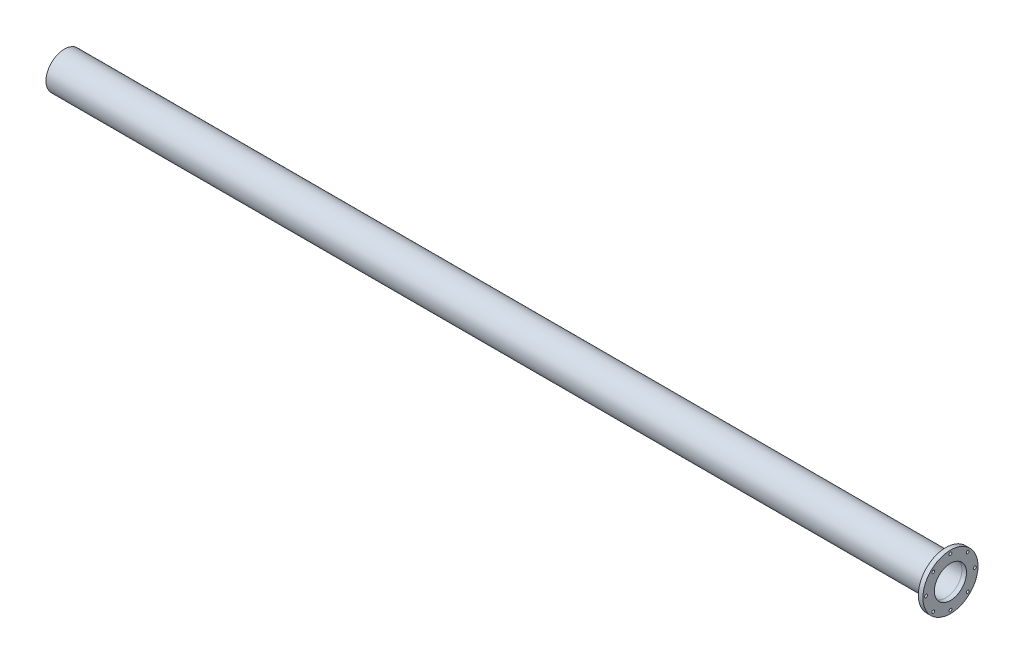
ISO-10303-21;
HEADER;
FILE_DESCRIPTION(('STEP AP214'),'2;1');
FILE_NAME('part.step','',(''),(''),'','','');
FILE_SCHEMA(('AUTOMOTIVE_DESIGN { 1 0 10303 214 1 1 1 1 }'));
ENDSEC;
DATA;
#1=APPLICATION_CONTEXT('core data for automotive mechanical design processes');
#2=APPLICATION_PROTOCOL_DEFINITION('international standard','automotive_design',2000,#1);
#3=PRODUCT_CONTEXT('',#1,'mechanical');
#4=PRODUCT('Part','Part','',(#3));
#5=PRODUCT_RELATED_PRODUCT_CATEGORY('part','',(#4));
#6=PRODUCT_DEFINITION_FORMATION('','',#4);
#7=PRODUCT_DEFINITION_CONTEXT('part definition',#1,'design');
#8=PRODUCT_DEFINITION('design','',#6,#7);
#9=PRODUCT_DEFINITION_SHAPE('','',#8);
#10=(LENGTH_UNIT() NAMED_UNIT(*) SI_UNIT(.MILLI.,.METRE.));
#11=(NAMED_UNIT(*) PLANE_ANGLE_UNIT() SI_UNIT($,.RADIAN.));
#12=(NAMED_UNIT(*) SI_UNIT($,.STERADIAN.) SOLID_ANGLE_UNIT());
#13=UNCERTAINTY_MEASURE_WITH_UNIT(LENGTH_MEASURE(1.E-05),#10,'distance_accuracy_value','');
#14=(GEOMETRIC_REPRESENTATION_CONTEXT(3) GLOBAL_UNCERTAINTY_ASSIGNED_CONTEXT((#13)) GLOBAL_UNIT_ASSIGNED_CONTEXT((#10,
#11,#12)) REPRESENTATION_CONTEXT('',''));
#15=CARTESIAN_POINT('',(0.,0.,0.));
#16=DIRECTION('',(0.,0.,1.));
#17=DIRECTION('',(1.,0.,0.));
#18=AXIS2_PLACEMENT_3D('',#15,#16,#17);
#19=CARTESIAN_POINT('',(1231.9,0.,0.));
#20=DIRECTION('',(1.,0.,0.));
#21=DIRECTION('',(0.,0.,-1.));
#22=AXIS2_PLACEMENT_3D('',#19,#20,#21);
#23=PLANE('',#22);
#24=CARTESIAN_POINT('',(1231.9,67.46875,2.35565881580073E-13));
#25=DIRECTION('',(1.,0.,0.));
#26=DIRECTION('',(0.,1.,0.));
#27=AXIS2_PLACEMENT_3D('',#24,#25,#26);
#28=CIRCLE('',#27,3.96874999999999);
#29=CARTESIAN_POINT('',(1231.9,71.4375,2.49422698143606E-13));
#30=VERTEX_POINT('',#29);
#31=EDGE_CURVE('E96',#30,#30,#28,.T.);
#32=ORIENTED_EDGE('',*,*,#31,.F.);
#33=EDGE_LOOP('',(#32));
#34=FACE_BOUND('',#33,.T.);
#35=CARTESIAN_POINT('',(1231.9,47.7076106431796,47.7076106431801));
#36=DIRECTION('',(1.,0.,0.));
#37=DIRECTION('',(0.,0.707106781186544,0.707106781186551));
#38=AXIS2_PLACEMENT_3D('',#35,#36,#37);
#39=CIRCLE('',#38,3.96874999999999);
#40=CARTESIAN_POINT('',(1231.9,50.5139406810137,50.5139406810142));
#41=VERTEX_POINT('',#40);
#42=EDGE_CURVE('E90',#41,#41,#39,.T.);
#43=ORIENTED_EDGE('',*,*,#42,.F.);
#44=EDGE_LOOP('',(#43));
#45=FACE_BOUND('',#44,.T.);
#46=CARTESIAN_POINT('',(1231.9,0.,67.46875));
#47=DIRECTION('',(1.,0.,0.));
#48=DIRECTION('',(0.,0.,1.));
#49=AXIS2_PLACEMENT_3D('',#46,#47,#48);
#50=CIRCLE('',#49,3.96874999999999);
#51=CARTESIAN_POINT('',(1231.9,0.,71.4375));
#52=VERTEX_POINT('',#51);
#53=EDGE_CURVE('E84',#52,#52,#50,.T.);
#54=ORIENTED_EDGE('',*,*,#53,.F.);
#55=EDGE_LOOP('',(#54));
#56=FACE_BOUND('',#55,.T.);
#57=CARTESIAN_POINT('',(1231.9,-47.7076106431803,47.7076106431795));
#58=DIRECTION('',(1.,0.,0.));
#59=DIRECTION('',(0.,-0.707106781186554,0.707106781186541));
#60=AXIS2_PLACEMENT_3D('',#57,#58,#59);
#61=CIRCLE('',#60,3.96874999999999);
#62=CARTESIAN_POINT('',(1231.9,-50.5139406810144,50.5139406810135));
#63=VERTEX_POINT('',#62);
#64=EDGE_CURVE('E77',#63,#63,#61,.T.);
#65=ORIENTED_EDGE('',*,*,#64,.F.);
#66=EDGE_LOOP('',(#65));
#67=FACE_BOUND('',#66,.T.);
#68=CARTESIAN_POINT('',(1231.9,-67.46875,-7.06697644740218E-13));
#69=DIRECTION('',(1.,0.,0.));
#70=DIRECTION('',(0.,-1.,0.));
#71=AXIS2_PLACEMENT_3D('',#68,#69,#70);
#72=CIRCLE('',#71,3.96874999999999);
#73=CARTESIAN_POINT('',(1231.9,-71.4375,-7.48268094430819E-13));
#74=VERTEX_POINT('',#73);
#75=EDGE_CURVE('E107',#74,#74,#72,.T.);
#76=ORIENTED_EDGE('',*,*,#75,.F.);
#77=EDGE_LOOP('',(#76));
#78=FACE_BOUND('',#77,.T.);
#79=CARTESIAN_POINT('',(1231.9,-47.7076106431793,-47.7076106431805));
#80=DIRECTION('',(1.,0.,0.));
#81=DIRECTION('',(0.,-0.707106781186539,-0.707106781186556));
#82=AXIS2_PLACEMENT_3D('',#79,#80,#81);
#83=CIRCLE('',#82,3.96874999999999);
#84=CARTESIAN_POINT('',(1231.9,-50.5139406810134,-50.5139406810146));
#85=VERTEX_POINT('',#84);
#86=EDGE_CURVE('E101',#85,#85,#83,.T.);
#87=ORIENTED_EDGE('',*,*,#86,.F.);
#88=EDGE_LOOP('',(#87));
#89=FACE_BOUND('',#88,.T.);
#90=CARTESIAN_POINT('',(1231.9,47.70761064318,-47.7076106431798));
#91=DIRECTION('',(1.,0.,0.));
#92=DIRECTION('',(0.,0.707106781186549,-0.707106781186546));
#93=AXIS2_PLACEMENT_3D('',#90,#91,#92);
#94=CIRCLE('',#93,3.96874999999999);
#95=CARTESIAN_POINT('',(1231.9,50.5139406810141,-50.5139406810139));
#96=VERTEX_POINT('',#95);
#97=EDGE_CURVE('E71',#96,#96,#94,.T.);
#98=ORIENTED_EDGE('',*,*,#97,.F.);
#99=EDGE_LOOP('',(#98));
#100=FACE_BOUND('',#99,.T.);
#101=CARTESIAN_POINT('',(1231.9,0.,-67.46875));
#102=DIRECTION('',(1.,0.,0.));
#103=DIRECTION('',(0.,0.,-1.));
#104=AXIS2_PLACEMENT_3D('',#101,#102,#103);
#105=CIRCLE('',#104,3.96874999999999);
#106=CARTESIAN_POINT('',(1231.9,0.,-71.4375));
#107=VERTEX_POINT('',#106);
#108=EDGE_CURVE('E65',#107,#107,#105,.T.);
#109=ORIENTED_EDGE('',*,*,#108,.F.);
#110=EDGE_LOOP('',(#109));
#111=FACE_BOUND('',#110,.T.);
#112=CARTESIAN_POINT('',(1231.9,0.,0.));
#113=DIRECTION('',(1.,0.,0.));
#114=DIRECTION('',(0.,0.,-1.));
#115=AXIS2_PLACEMENT_3D('',#112,#113,#114);
#116=CIRCLE('',#115,76.2);
#117=CARTESIAN_POINT('',(1231.9,0.,-76.2));
#118=VERTEX_POINT('',#117);
#119=EDGE_CURVE('E11',#118,#118,#116,.T.);
#120=ORIENTED_EDGE('',*,*,#119,.T.);
#121=EDGE_LOOP('',(#120));
#122=FACE_BOUND('',#121,.T.);
#123=CARTESIAN_POINT('',(1231.9,0.,0.));
#124=DIRECTION('',(1.,0.,0.));
#125=DIRECTION('',(0.,0.,-1.));
#126=AXIS2_PLACEMENT_3D('',#123,#124,#125);
#127=CIRCLE('',#126,44.45);
#128=CARTESIAN_POINT('',(1231.9,0.,-44.45));
#129=VERTEX_POINT('',#128);
#130=EDGE_CURVE('E57',#129,#129,#127,.T.);
#131=ORIENTED_EDGE('',*,*,#130,.F.);
#132=EDGE_LOOP('',(#131));
#133=FACE_BOUND('',#132,.T.);
#134=ADVANCED_FACE('F46',(#34,#45,#56,#67,#78,#89,#100,#111,#122,#133),#23,.T.);
#135=CARTESIAN_POINT('',(1219.2,0.,0.));
#136=DIRECTION('',(1.,0.,0.));
#137=DIRECTION('',(0.,0.,-1.));
#138=AXIS2_PLACEMENT_3D('',#135,#136,#137);
#139=PLANE('',#138);
#140=CARTESIAN_POINT('',(1219.2,67.46875,2.35565881580073E-13));
#141=DIRECTION('',(1.,0.,0.));
#142=DIRECTION('',(0.,1.,0.));
#143=AXIS2_PLACEMENT_3D('',#140,#141,#142);
#144=CIRCLE('',#143,3.96874999999999);
#145=CARTESIAN_POINT('',(1219.2,71.4375,2.49422698143606E-13));
#146=VERTEX_POINT('',#145);
#147=EDGE_CURVE('E74',#146,#146,#144,.T.);
#148=ORIENTED_EDGE('',*,*,#147,.T.);
#149=EDGE_LOOP('',(#148));
#150=FACE_BOUND('',#149,.T.);
#151=CARTESIAN_POINT('',(1219.2,47.7076106431796,47.7076106431801));
#152=DIRECTION('',(1.,0.,0.));
#153=DIRECTION('',(0.,0.707106781186544,0.707106781186551));
#154=AXIS2_PLACEMENT_3D('',#151,#152,#153);
#155=CIRCLE('',#154,3.96874999999999);
#156=CARTESIAN_POINT('',(1219.2,50.5139406810137,50.5139406810142));
#157=VERTEX_POINT('',#156);
#158=EDGE_CURVE('E93',#157,#157,#155,.T.);
#159=ORIENTED_EDGE('',*,*,#158,.T.);
#160=EDGE_LOOP('',(#159));
#161=FACE_BOUND('',#160,.T.);
#162=CARTESIAN_POINT('',(1219.2,0.,67.46875));
#163=DIRECTION('',(1.,0.,0.));
#164=DIRECTION('',(0.,0.,1.));
#165=AXIS2_PLACEMENT_3D('',#162,#163,#164);
#166=CIRCLE('',#165,3.96874999999999);
#167=CARTESIAN_POINT('',(1219.2,0.,71.4375));
#168=VERTEX_POINT('',#167);
#169=EDGE_CURVE('E87',#168,#168,#166,.T.);
#170=ORIENTED_EDGE('',*,*,#169,.T.);
#171=EDGE_LOOP('',(#170));
#172=FACE_BOUND('',#171,.T.);
#173=CARTESIAN_POINT('',(1219.2,-47.7076106431803,47.7076106431795));
#174=DIRECTION('',(1.,0.,0.));
#175=DIRECTION('',(0.,-0.707106781186554,0.707106781186541));
#176=AXIS2_PLACEMENT_3D('',#173,#174,#175);
#177=CIRCLE('',#176,3.96874999999999);
#178=CARTESIAN_POINT('',(1219.2,-50.5139406810144,50.5139406810135));
#179=VERTEX_POINT('',#178);
#180=EDGE_CURVE('E80',#179,#179,#177,.T.);
#181=ORIENTED_EDGE('',*,*,#180,.T.);
#182=EDGE_LOOP('',(#181));
#183=FACE_BOUND('',#182,.T.);
#184=CARTESIAN_POINT('',(1219.2,-67.46875,-7.06697644740218E-13));
#185=DIRECTION('',(1.,0.,0.));
#186=DIRECTION('',(0.,-1.,0.));
#187=AXIS2_PLACEMENT_3D('',#184,#185,#186);
#188=CIRCLE('',#187,3.96874999999999);
#189=CARTESIAN_POINT('',(1219.2,-71.4375,-7.48268094430819E-13));
#190=VERTEX_POINT('',#189);
#191=EDGE_CURVE('E81',#190,#190,#188,.T.);
#192=ORIENTED_EDGE('',*,*,#191,.T.);
#193=EDGE_LOOP('',(#192));
#194=FACE_BOUND('',#193,.T.);
#195=CARTESIAN_POINT('',(1219.2,-47.7076106431793,-47.7076106431805));
#196=DIRECTION('',(1.,0.,0.));
#197=DIRECTION('',(0.,-0.707106781186539,-0.707106781186556));
#198=AXIS2_PLACEMENT_3D('',#195,#196,#197);
#199=CIRCLE('',#198,3.96874999999999);
#200=CARTESIAN_POINT('',(1219.2,-50.5139406810134,-50.5139406810146));
#201=VERTEX_POINT('',#200);
#202=EDGE_CURVE('E104',#201,#201,#199,.T.);
#203=ORIENTED_EDGE('',*,*,#202,.T.);
#204=EDGE_LOOP('',(#203));
#205=FACE_BOUND('',#204,.T.);
#206=CARTESIAN_POINT('',(1219.2,47.70761064318,-47.7076106431798));
#207=DIRECTION('',(1.,0.,0.));
#208=DIRECTION('',(0.,0.707106781186549,-0.707106781186546));
#209=AXIS2_PLACEMENT_3D('',#206,#207,#208);
#210=CIRCLE('',#209,3.96874999999999);
#211=CARTESIAN_POINT('',(1219.2,50.5139406810141,-50.5139406810139));
#212=VERTEX_POINT('',#211);
#213=EDGE_CURVE('E68',#212,#212,#210,.T.);
#214=ORIENTED_EDGE('',*,*,#213,.T.);
#215=EDGE_LOOP('',(#214));
#216=FACE_BOUND('',#215,.T.);
#217=CARTESIAN_POINT('',(1219.2,0.,-67.46875));
#218=DIRECTION('',(1.,0.,0.));
#219=DIRECTION('',(0.,0.,-1.));
#220=AXIS2_PLACEMENT_3D('',#217,#218,#219);
#221=CIRCLE('',#220,3.96874999999999);
#222=CARTESIAN_POINT('',(1219.2,0.,-71.4375));
#223=VERTEX_POINT('',#222);
#224=EDGE_CURVE('E62',#223,#223,#221,.T.);
#225=ORIENTED_EDGE('',*,*,#224,.T.);
#226=EDGE_LOOP('',(#225));
#227=FACE_BOUND('',#226,.T.);
#228=CARTESIAN_POINT('',(1219.2,0.,0.));
#229=DIRECTION('',(1.,0.,0.));
#230=DIRECTION('',(0.,0.,-1.));
#231=AXIS2_PLACEMENT_3D('',#228,#229,#230);
#232=CIRCLE('',#231,76.2);
#233=CARTESIAN_POINT('',(1219.2,0.,-76.2));
#234=VERTEX_POINT('',#233);
#235=EDGE_CURVE('E50',#234,#234,#232,.T.);
#236=ORIENTED_EDGE('',*,*,#235,.F.);
#237=EDGE_LOOP('',(#236));
#238=FACE_BOUND('',#237,.T.);
#239=CARTESIAN_POINT('',(1219.2,0.,0.));
#240=DIRECTION('',(1.,0.,0.));
#241=DIRECTION('',(0.,0.,-1.));
#242=AXIS2_PLACEMENT_3D('',#239,#240,#241);
#243=CIRCLE('',#242,44.45);
#244=CARTESIAN_POINT('',(1219.2,0.,-44.45));
#245=VERTEX_POINT('',#244);
#246=EDGE_CURVE('E59',#245,#245,#243,.T.);
#247=ORIENTED_EDGE('',*,*,#246,.T.);
#248=EDGE_LOOP('',(#247));
#249=FACE_BOUND('',#248,.T.);
#250=ADVANCED_FACE('F113',(#150,#161,#172,#183,#194,#205,#216,#227,#238,#249),#139,.F.);
#251=CARTESIAN_POINT('',(1231.9,0.,0.));
#252=DIRECTION('',(-1.,0.,0.));
#253=DIRECTION('',(0.,0.,1.));
#254=AXIS2_PLACEMENT_3D('',#251,#252,#253);
#255=CYLINDRICAL_SURFACE('',#254,76.2);
#256=ORIENTED_EDGE('',*,*,#119,.F.);
#257=EDGE_LOOP('',(#256));
#258=FACE_BOUND('',#257,.T.);
#259=ORIENTED_EDGE('',*,*,#235,.T.);
#260=EDGE_LOOP('',(#259));
#261=FACE_BOUND('',#260,.T.);
#262=ADVANCED_FACE('F48',(#258,#261),#255,.T.);
#263=CARTESIAN_POINT('',(1231.9,0.,0.));
#264=DIRECTION('',(-1.,0.,0.));
#265=DIRECTION('',(0.,0.,1.));
#266=AXIS2_PLACEMENT_3D('',#263,#264,#265);
#267=CYLINDRICAL_SURFACE('',#266,44.45);
#268=ORIENTED_EDGE('',*,*,#130,.T.);
#269=EDGE_LOOP('',(#268));
#270=FACE_BOUND('',#269,.T.);
#271=ORIENTED_EDGE('',*,*,#246,.F.);
#272=EDGE_LOOP('',(#271));
#273=FACE_BOUND('',#272,.T.);
#274=ADVANCED_FACE('F136',(#270,#273),#267,.F.);
#275=CARTESIAN_POINT('',(1219.2,0.,-67.46875));
#276=DIRECTION('',(1.,0.,0.));
#277=DIRECTION('',(0.,0.,-1.));
#278=AXIS2_PLACEMENT_3D('',#275,#276,#277);
#279=CYLINDRICAL_SURFACE('',#278,3.96874999999999);
#280=ORIENTED_EDGE('',*,*,#224,.F.);
#281=EDGE_LOOP('',(#280));
#282=FACE_BOUND('',#281,.T.);
#283=ORIENTED_EDGE('',*,*,#108,.T.);
#284=EDGE_LOOP('',(#283));
#285=FACE_BOUND('',#284,.T.);
#286=ADVANCED_FACE('F139',(#282,#285),#279,.F.);
#287=CARTESIAN_POINT('',(1219.2,47.70761064318,-47.7076106431798));
#288=DIRECTION('',(1.,0.,0.));
#289=DIRECTION('',(0.,0.,-1.));
#290=AXIS2_PLACEMENT_3D('',#287,#288,#289);
#291=CYLINDRICAL_SURFACE('',#290,3.96874999999999);
#292=ORIENTED_EDGE('',*,*,#213,.F.);
#293=EDGE_LOOP('',(#292));
#294=FACE_BOUND('',#293,.T.);
#295=ORIENTED_EDGE('',*,*,#97,.T.);
#296=EDGE_LOOP('',(#295));
#297=FACE_BOUND('',#296,.T.);
#298=ADVANCED_FACE('F153',(#294,#297),#291,.F.);
#299=CARTESIAN_POINT('',(1219.2,-47.7076106431793,-47.7076106431805));
#300=DIRECTION('',(1.,0.,0.));
#301=DIRECTION('',(0.,0.,-1.));
#302=AXIS2_PLACEMENT_3D('',#299,#300,#301);
#303=CYLINDRICAL_SURFACE('',#302,3.96874999999999);
#304=ORIENTED_EDGE('',*,*,#202,.F.);
#305=EDGE_LOOP('',(#304));
#306=FACE_BOUND('',#305,.T.);
#307=ORIENTED_EDGE('',*,*,#86,.T.);
#308=EDGE_LOOP('',(#307));
#309=FACE_BOUND('',#308,.T.);
#310=ADVANCED_FACE('F120',(#306,#309),#303,.F.);
#311=CARTESIAN_POINT('',(1219.2,-67.46875,-7.06697644740218E-13));
#312=DIRECTION('',(1.,0.,0.));
#313=DIRECTION('',(0.,0.,-1.));
#314=AXIS2_PLACEMENT_3D('',#311,#312,#313);
#315=CYLINDRICAL_SURFACE('',#314,3.96874999999999);
#316=ORIENTED_EDGE('',*,*,#191,.F.);
#317=EDGE_LOOP('',(#316));
#318=FACE_BOUND('',#317,.T.);
#319=ORIENTED_EDGE('',*,*,#75,.T.);
#320=EDGE_LOOP('',(#319));
#321=FACE_BOUND('',#320,.T.);
#322=ADVANCED_FACE('F116',(#318,#321),#315,.F.);
#323=CARTESIAN_POINT('',(1219.2,-47.7076106431803,47.7076106431795));
#324=DIRECTION('',(1.,0.,0.));
#325=DIRECTION('',(0.,0.,-1.));
#326=AXIS2_PLACEMENT_3D('',#323,#324,#325);
#327=CYLINDRICAL_SURFACE('',#326,3.96874999999999);
#328=ORIENTED_EDGE('',*,*,#180,.F.);
#329=EDGE_LOOP('',(#328));
#330=FACE_BOUND('',#329,.T.);
#331=ORIENTED_EDGE('',*,*,#64,.T.);
#332=EDGE_LOOP('',(#331));
#333=FACE_BOUND('',#332,.T.);
#334=ADVANCED_FACE('F119',(#330,#333),#327,.F.);
#335=CARTESIAN_POINT('',(1219.2,0.,67.46875));
#336=DIRECTION('',(1.,0.,0.));
#337=DIRECTION('',(0.,0.,-1.));
#338=AXIS2_PLACEMENT_3D('',#335,#336,#337);
#339=CYLINDRICAL_SURFACE('',#338,3.96874999999999);
#340=ORIENTED_EDGE('',*,*,#169,.F.);
#341=EDGE_LOOP('',(#340));
#342=FACE_BOUND('',#341,.T.);
#343=ORIENTED_EDGE('',*,*,#53,.T.);
#344=EDGE_LOOP('',(#343));
#345=FACE_BOUND('',#344,.T.);
#346=ADVANCED_FACE('F160',(#342,#345),#339,.F.);
#347=CARTESIAN_POINT('',(1219.2,47.7076106431796,47.7076106431801));
#348=DIRECTION('',(1.,0.,0.));
#349=DIRECTION('',(0.,0.,-1.));
#350=AXIS2_PLACEMENT_3D('',#347,#348,#349);
#351=CYLINDRICAL_SURFACE('',#350,3.96874999999999);
#352=ORIENTED_EDGE('',*,*,#158,.F.);
#353=EDGE_LOOP('',(#352));
#354=FACE_BOUND('',#353,.T.);
#355=ORIENTED_EDGE('',*,*,#42,.T.);
#356=EDGE_LOOP('',(#355));
#357=FACE_BOUND('',#356,.T.);
#358=ADVANCED_FACE('F164',(#354,#357),#351,.F.);
#359=CARTESIAN_POINT('',(1219.2,67.46875,2.35565881580073E-13));
#360=DIRECTION('',(1.,0.,0.));
#361=DIRECTION('',(0.,0.,-1.));
#362=AXIS2_PLACEMENT_3D('',#359,#360,#361);
#363=CYLINDRICAL_SURFACE('',#362,3.96874999999999);
#364=ORIENTED_EDGE('',*,*,#147,.F.);
#365=EDGE_LOOP('',(#364));
#366=FACE_BOUND('',#365,.T.);
#367=ORIENTED_EDGE('',*,*,#31,.T.);
#368=EDGE_LOOP('',(#367));
#369=FACE_BOUND('',#368,.T.);
#370=ADVANCED_FACE('F168',(#366,#369),#363,.F.);
#371=CLOSED_SHELL('',(#134,#250,#262,#274,#286,#298,#310,#322,#334,#346,#358,#370));
#372=MANIFOLD_SOLID_BREP('B2',#371);
#373=CARTESIAN_POINT('',(-1219.2,0.,0.));
#374=DIRECTION('',(1.,0.,0.));
#375=DIRECTION('',(0.,0.,-1.));
#376=AXIS2_PLACEMENT_3D('',#373,#374,#375);
#377=CYLINDRICAL_SURFACE('',#376,50.8);
#378=CARTESIAN_POINT('',(-1219.2,0.,0.));
#379=DIRECTION('',(1.,0.,0.));
#380=DIRECTION('',(0.,0.,-1.));
#381=AXIS2_PLACEMENT_3D('',#378,#379,#380);
#382=CIRCLE('',#381,50.8);
#383=CARTESIAN_POINT('',(-1219.2,0.,-50.8));
#384=VERTEX_POINT('',#383);
#385=EDGE_CURVE('E45',#384,#384,#382,.T.);
#386=ORIENTED_EDGE('',*,*,#385,.T.);
#387=EDGE_LOOP('',(#386));
#388=FACE_BOUND('',#387,.T.);
#389=CARTESIAN_POINT('',(1219.2,0.,0.));
#390=DIRECTION('',(1.,0.,0.));
#391=DIRECTION('',(0.,0.,-1.));
#392=AXIS2_PLACEMENT_3D('',#389,#390,#391);
#393=CIRCLE('',#392,50.8);
#394=CARTESIAN_POINT('',(1219.2,0.,-50.8));
#395=VERTEX_POINT('',#394);
#396=EDGE_CURVE('E285',#395,#395,#393,.T.);
#397=ORIENTED_EDGE('',*,*,#396,.F.);
#398=EDGE_LOOP('',(#397));
#399=FACE_BOUND('',#398,.T.);
#400=ADVANCED_FACE('F275',(#388,#399),#377,.T.);
#401=CARTESIAN_POINT('',(-1219.2,0.,0.));
#402=DIRECTION('',(1.,0.,0.));
#403=DIRECTION('',(0.,0.,-1.));
#404=AXIS2_PLACEMENT_3D('',#401,#402,#403);
#405=PLANE('',#404);
#406=CARTESIAN_POINT('',(-1219.2,0.,0.));
#407=DIRECTION('',(1.,0.,0.));
#408=DIRECTION('',(0.,0.,-1.));
#409=AXIS2_PLACEMENT_3D('',#406,#407,#408);
#410=CIRCLE('',#409,44.45);
#411=CARTESIAN_POINT('',(-1219.2,0.,-44.45));
#412=VERTEX_POINT('',#411);
#413=EDGE_CURVE('E281',#412,#412,#410,.T.);
#414=ORIENTED_EDGE('',*,*,#413,.T.);
#415=EDGE_LOOP('',(#414));
#416=FACE_BOUND('',#415,.T.);
#417=ORIENTED_EDGE('',*,*,#385,.F.);
#418=EDGE_LOOP('',(#417));
#419=FACE_BOUND('',#418,.T.);
#420=ADVANCED_FACE('F304',(#416,#419),#405,.F.);
#421=CARTESIAN_POINT('',(-1219.2,0.,0.));
#422=DIRECTION('',(1.,0.,0.));
#423=DIRECTION('',(0.,0.,-1.));
#424=AXIS2_PLACEMENT_3D('',#421,#422,#423);
#425=CYLINDRICAL_SURFACE('',#424,44.45);
#426=ORIENTED_EDGE('',*,*,#413,.F.);
#427=EDGE_LOOP('',(#426));
#428=FACE_BOUND('',#427,.T.);
#429=CARTESIAN_POINT('',(1219.2,0.,0.));
#430=DIRECTION('',(1.,0.,0.));
#431=DIRECTION('',(0.,0.,-1.));
#432=AXIS2_PLACEMENT_3D('',#429,#430,#431);
#433=CIRCLE('',#432,44.45);
#434=CARTESIAN_POINT('',(1219.2,0.,-44.45));
#435=VERTEX_POINT('',#434);
#436=EDGE_CURVE('E289',#435,#435,#433,.T.);
#437=ORIENTED_EDGE('',*,*,#436,.T.);
#438=EDGE_LOOP('',(#437));
#439=FACE_BOUND('',#438,.T.);
#440=ADVANCED_FACE('F295',(#428,#439),#425,.F.);
#441=CARTESIAN_POINT('',(1219.2,0.,0.));
#442=DIRECTION('',(1.,0.,0.));
#443=DIRECTION('',(0.,0.,-1.));
#444=AXIS2_PLACEMENT_3D('',#441,#442,#443);
#445=PLANE('',#444);
#446=ORIENTED_EDGE('',*,*,#396,.T.);
#447=EDGE_LOOP('',(#446));
#448=FACE_BOUND('',#447,.T.);
#449=ORIENTED_EDGE('',*,*,#436,.F.);
#450=EDGE_LOOP('',(#449));
#451=FACE_BOUND('',#450,.T.);
#452=ADVANCED_FACE('F297',(#448,#451),#445,.T.);
#453=CLOSED_SHELL('',(#400,#420,#440,#452));
#454=MANIFOLD_SOLID_BREP('B6',#453);
#455=ADVANCED_BREP_SHAPE_REPRESENTATION('',(#18,#372,#454),#14);
#456=SHAPE_DEFINITION_REPRESENTATION(#9,#455);
ENDSEC;
END-ISO-10303-21;
